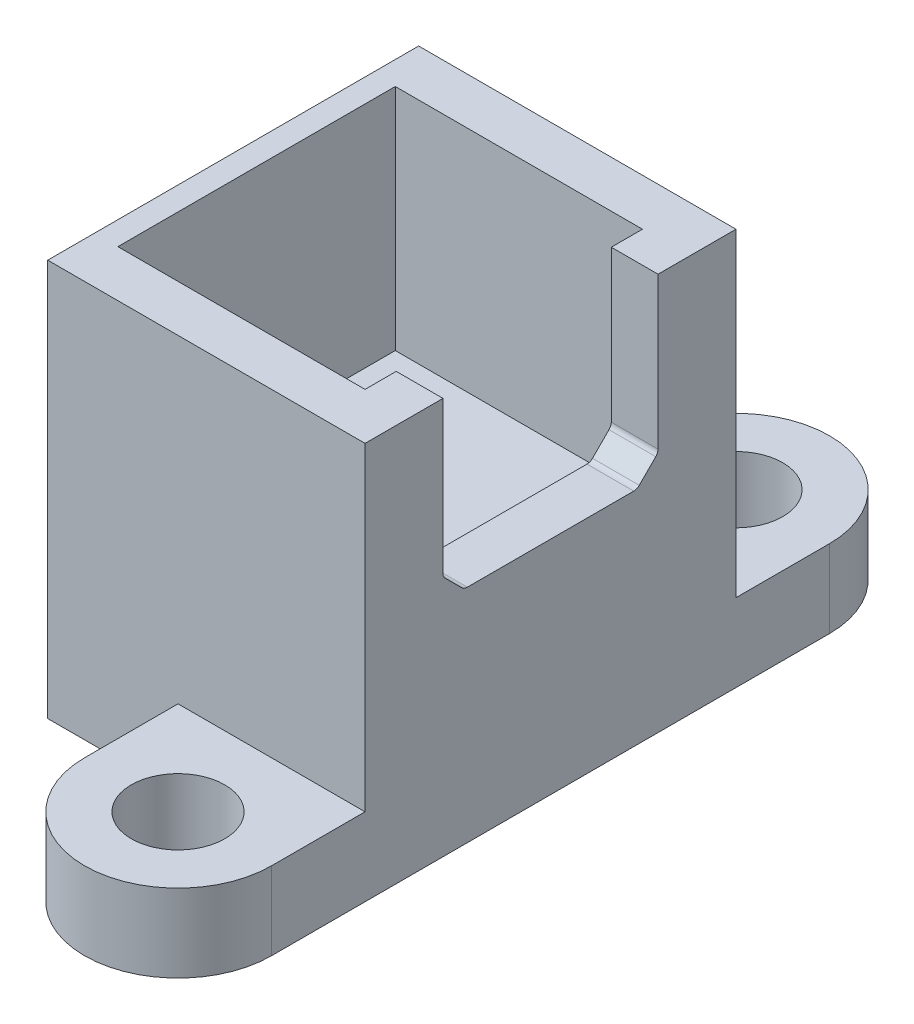
ISO-10303-21;
HEADER;
FILE_DESCRIPTION(('STEP AP214'),'2;1');
FILE_NAME('part.step','',(''),(''),'','','');
FILE_SCHEMA(('AUTOMOTIVE_DESIGN { 1 0 10303 214 1 1 1 1 }'));
ENDSEC;
DATA;
#1=APPLICATION_CONTEXT('core data for automotive mechanical design processes');
#2=APPLICATION_PROTOCOL_DEFINITION('international standard','automotive_design',2000,#1);
#3=PRODUCT_CONTEXT('',#1,'mechanical');
#4=PRODUCT('Part','Part','',(#3));
#5=PRODUCT_RELATED_PRODUCT_CATEGORY('part','',(#4));
#6=PRODUCT_DEFINITION_FORMATION('','',#4);
#7=PRODUCT_DEFINITION_CONTEXT('part definition',#1,'design');
#8=PRODUCT_DEFINITION('design','',#6,#7);
#9=PRODUCT_DEFINITION_SHAPE('','',#8);
#10=(LENGTH_UNIT() NAMED_UNIT(*) SI_UNIT(.MILLI.,.METRE.));
#11=(NAMED_UNIT(*) PLANE_ANGLE_UNIT() SI_UNIT($,.RADIAN.));
#12=(NAMED_UNIT(*) SI_UNIT($,.STERADIAN.) SOLID_ANGLE_UNIT());
#13=UNCERTAINTY_MEASURE_WITH_UNIT(LENGTH_MEASURE(1.E-05),#10,'distance_accuracy_value','');
#14=(GEOMETRIC_REPRESENTATION_CONTEXT(3) GLOBAL_UNCERTAINTY_ASSIGNED_CONTEXT((#13)) GLOBAL_UNIT_ASSIGNED_CONTEXT((#10,
#11,#12)) REPRESENTATION_CONTEXT('',''));
#15=CARTESIAN_POINT('',(0.,0.,0.));
#16=DIRECTION('',(0.,0.,1.));
#17=DIRECTION('',(1.,0.,0.));
#18=AXIS2_PLACEMENT_3D('',#15,#16,#17);
#19=CARTESIAN_POINT('',(-97.7656372295594,0.,-42.9629784183495));
#20=DIRECTION('',(0.,0.,-1.));
#21=DIRECTION('',(0.,1.,0.));
#22=AXIS2_PLACEMENT_3D('',#19,#20,#21);
#23=PLANE('',#22);
#24=DIRECTION('',(0.,-1.,0.));
#25=VECTOR('',#24,1.);
#26=CARTESIAN_POINT('',(-102.265637229559,-58.5367120778325,-42.9629784183496));
#27=LINE('',#26,#25);
#28=CARTESIAN_POINT('',(-102.265637229559,-58.5367120778325,-42.9629784183496));
#29=VERTEX_POINT('',#28);
#30=CARTESIAN_POINT('',(-102.265637229559,-61.0367120778325,-42.9629784183496));
#31=VERTEX_POINT('',#30);
#32=EDGE_CURVE('E264',#29,#31,#27,.T.);
#33=ORIENTED_EDGE('',*,*,#32,.F.);
#34=DIRECTION('',(-1.,0.,0.));
#35=VECTOR('',#34,1.);
#36=CARTESIAN_POINT('',(0.,-58.5367120778325,-42.9629784183496));
#37=LINE('',#36,#35);
#38=CARTESIAN_POINT('',(-96.2656372295594,-58.5367120778325,-42.9629784183496));
#39=VERTEX_POINT('',#38);
#40=EDGE_CURVE('E247',#39,#29,#37,.T.);
#41=ORIENTED_EDGE('',*,*,#40,.F.);
#42=DIRECTION('',(0.,1.,0.));
#43=VECTOR('',#42,1.);
#44=CARTESIAN_POINT('',(-96.2656372295594,0.,-42.9629784183495));
#45=LINE('',#44,#43);
#46=CARTESIAN_POINT('',(-96.2656372295594,-48.3001004236337,-42.9629784183496));
#47=VERTEX_POINT('',#46);
#48=EDGE_CURVE('E352',#39,#47,#45,.T.);
#49=ORIENTED_EDGE('',*,*,#48,.T.);
#50=DIRECTION('',(1.,0.,0.));
#51=VECTOR('',#50,1.);
#52=CARTESIAN_POINT('',(-97.7656372295594,-48.3001004236337,-42.9629784183496));
#53=LINE('',#52,#51);
#54=CARTESIAN_POINT('',(-106.445637229559,-48.3001004236337,-42.9629784183496));
#55=VERTEX_POINT('',#54);
#56=EDGE_CURVE('E392',#55,#47,#53,.T.);
#57=ORIENTED_EDGE('',*,*,#56,.F.);
#58=DIRECTION('',(0.,-1.,0.));
#59=VECTOR('',#58,1.);
#60=CARTESIAN_POINT('',(-106.445637229559,-89.8871446844111,-42.9629784183496));
#61=LINE('',#60,#59);
#62=CARTESIAN_POINT('',(-106.445637229559,-61.0367120778325,-42.9629784183496));
#63=VERTEX_POINT('',#62);
#64=EDGE_CURVE('E272',#55,#63,#61,.T.);
#65=ORIENTED_EDGE('',*,*,#64,.T.);
#66=DIRECTION('',(1.,0.,0.));
#67=VECTOR('',#66,1.);
#68=CARTESIAN_POINT('',(-97.7656372295594,-61.0367120778325,-42.9629784183496));
#69=LINE('',#68,#67);
#70=EDGE_CURVE('E64',#63,#31,#69,.T.);
#71=ORIENTED_EDGE('',*,*,#70,.T.);
#72=EDGE_LOOP('',(#33,#41,#49,#57,#65,#71));
#73=FACE_BOUND('',#72,.T.);
#74=ADVANCED_FACE('F41',(#73),#23,.F.);
#75=CARTESIAN_POINT('',(-97.7656372295594,-53.1562824381008,-52.1128788676088));
#76=DIRECTION('',(1.,0.,0.));
#77=DIRECTION('',(0.,0.,-1.));
#78=AXIS2_PLACEMENT_3D('',#75,#76,#77);
#79=CYLINDRICAL_SURFACE('',#78,0.250140786007739);
#80=CARTESIAN_POINT('',(-96.2656372295594,-53.1562824381008,-52.1128788676088));
#81=DIRECTION('',(-1.,0.,0.));
#82=DIRECTION('',(0.,0.,1.));
#83=AXIS2_PLACEMENT_3D('',#80,#81,#82);
#84=CIRCLE('',#83,0.250140786007739);
#85=CARTESIAN_POINT('',(-96.2656372295594,-53.3331586841382,-52.2897551136462));
#86=VERTEX_POINT('',#85);
#87=CARTESIAN_POINT('',(-96.2656372295594,-53.1608241936896,-52.3629784183496));
#88=VERTEX_POINT('',#87);
#89=EDGE_CURVE('E298',#86,#88,#84,.F.);
#90=ORIENTED_EDGE('',*,*,#89,.T.);
#91=DIRECTION('',(1.,0.,0.));
#92=VECTOR('',#91,1.);
#93=CARTESIAN_POINT('',(-97.7656372295594,-53.1608241936896,-52.3629784183496));
#94=LINE('',#93,#92);
#95=CARTESIAN_POINT('',(-97.7656372295594,-53.1608241936896,-52.3629784183496));
#96=VERTEX_POINT('',#95);
#97=EDGE_CURVE('E11',#96,#88,#94,.T.);
#98=ORIENTED_EDGE('',*,*,#97,.F.);
#99=CARTESIAN_POINT('',(-97.7656372295594,-53.1562824381008,-52.1128788676088));
#100=DIRECTION('',(-1.,0.,0.));
#101=DIRECTION('',(0.,0.,1.));
#102=AXIS2_PLACEMENT_3D('',#99,#100,#101);
#103=CIRCLE('',#102,0.250140786007739);
#104=CARTESIAN_POINT('',(-97.7656372295594,-53.3331586841382,-52.2897551136462));
#105=VERTEX_POINT('',#104);
#106=EDGE_CURVE('E312',#105,#96,#103,.F.);
#107=ORIENTED_EDGE('',*,*,#106,.F.);
#108=DIRECTION('',(1.,0.,0.));
#109=VECTOR('',#108,1.);
#110=CARTESIAN_POINT('',(-97.7656372295594,-53.3331586841382,-52.2897551136462));
#111=LINE('',#110,#109);
#112=EDGE_CURVE('E339',#105,#86,#111,.T.);
#113=ORIENTED_EDGE('',*,*,#112,.T.);
#114=EDGE_LOOP('',(#90,#98,#107,#113));
#115=FACE_BOUND('',#114,.T.);
#116=ADVANCED_FACE('F43',(#115),#79,.F.);
#117=CARTESIAN_POINT('',(-97.7656372295594,0.,-52.3629784183496));
#118=DIRECTION('',(0.,0.,-1.));
#119=DIRECTION('',(-1.,0.,0.));
#120=AXIS2_PLACEMENT_3D('',#117,#118,#119);
#121=PLANE('',#120);
#122=DIRECTION('',(0.,1.,0.));
#123=VECTOR('',#122,1.);
#124=CARTESIAN_POINT('',(-96.2656372295594,0.,-52.3629784183496));
#125=LINE('',#124,#123);
#126=CARTESIAN_POINT('',(-96.2656372295594,-48.3001004236337,-52.3629784183496));
#127=VERTEX_POINT('',#126);
#128=EDGE_CURVE('E342',#88,#127,#125,.T.);
#129=ORIENTED_EDGE('',*,*,#128,.T.);
#130=DIRECTION('',(1.,0.,0.));
#131=VECTOR('',#130,1.);
#132=CARTESIAN_POINT('',(-97.7656372295594,-48.3001004236337,-52.3629784183496));
#133=LINE('',#132,#131);
#134=CARTESIAN_POINT('',(-97.7656372295594,-48.3001004236337,-52.3629784183496));
#135=VERTEX_POINT('',#134);
#136=EDGE_CURVE('E49',#135,#127,#133,.T.);
#137=ORIENTED_EDGE('',*,*,#136,.F.);
#138=DIRECTION('',(0.,1.,0.));
#139=VECTOR('',#138,1.);
#140=CARTESIAN_POINT('',(-97.7656372295594,0.,-52.3629784183496));
#141=LINE('',#140,#139);
#142=EDGE_CURVE('E315',#96,#135,#141,.T.);
#143=ORIENTED_EDGE('',*,*,#142,.F.);
#144=ORIENTED_EDGE('',*,*,#97,.T.);
#145=EDGE_LOOP('',(#129,#137,#143,#144));
#146=FACE_BOUND('',#145,.T.);
#147=ADVANCED_FACE('F406',(#146),#121,.F.);
#148=CARTESIAN_POINT('',(-97.7656372295594,0.,-54.8629784183496));
#149=DIRECTION('',(0.,0.,-1.));
#150=DIRECTION('',(-1.,0.,0.));
#151=AXIS2_PLACEMENT_3D('',#148,#149,#150);
#152=PLANE('',#151);
#153=DIRECTION('',(1.,0.,0.));
#154=VECTOR('',#153,1.);
#155=CARTESIAN_POINT('',(0.,-58.5367120778325,-54.8629784183496));
#156=LINE('',#155,#154);
#157=CARTESIAN_POINT('',(-102.265637229559,-58.5367120778325,-54.8629784183496));
#158=VERTEX_POINT('',#157);
#159=CARTESIAN_POINT('',(-96.2656372295594,-58.5367120778325,-54.8629784183496));
#160=VERTEX_POINT('',#159);
#161=EDGE_CURVE('E211',#158,#160,#156,.T.);
#162=ORIENTED_EDGE('',*,*,#161,.F.);
#163=DIRECTION('',(0.,-1.,0.));
#164=VECTOR('',#163,1.);
#165=CARTESIAN_POINT('',(-102.265637229559,-58.5367120778325,-54.8629784183496));
#166=LINE('',#165,#164);
#167=CARTESIAN_POINT('',(-102.265637229559,-61.0367120778325,-54.8629784183496));
#168=VERTEX_POINT('',#167);
#169=EDGE_CURVE('E223',#158,#168,#166,.T.);
#170=ORIENTED_EDGE('',*,*,#169,.T.);
#171=DIRECTION('',(1.,0.,0.));
#172=VECTOR('',#171,1.);
#173=CARTESIAN_POINT('',(-97.7656372295594,-61.0367120778325,-54.8629784183496));
#174=LINE('',#173,#172);
#175=CARTESIAN_POINT('',(-106.445637229559,-61.0367120778325,-54.8629784183496));
#176=VERTEX_POINT('',#175);
#177=EDGE_CURVE('E396',#176,#168,#174,.T.);
#178=ORIENTED_EDGE('',*,*,#177,.F.);
#179=DIRECTION('',(0.,-1.,0.));
#180=VECTOR('',#179,1.);
#181=CARTESIAN_POINT('',(-106.445637229559,-89.8871446844113,-54.8629784183496));
#182=LINE('',#181,#180);
#183=CARTESIAN_POINT('',(-106.445637229559,-48.3001004236337,-54.8629784183496));
#184=VERTEX_POINT('',#183);
#185=EDGE_CURVE('E276',#184,#176,#182,.T.);
#186=ORIENTED_EDGE('',*,*,#185,.F.);
#187=DIRECTION('',(1.,0.,0.));
#188=VECTOR('',#187,1.);
#189=CARTESIAN_POINT('',(-97.7656372295594,-48.3001004236337,-54.8629784183496));
#190=LINE('',#189,#188);
#191=CARTESIAN_POINT('',(-96.2656372295594,-48.3001004236337,-54.8629784183496));
#192=VERTEX_POINT('',#191);
#193=EDGE_CURVE('E399',#184,#192,#190,.T.);
#194=ORIENTED_EDGE('',*,*,#193,.T.);
#195=DIRECTION('',(0.,1.,0.));
#196=VECTOR('',#195,1.);
#197=CARTESIAN_POINT('',(-96.2656372295594,0.,-54.8629784183496));
#198=LINE('',#197,#196);
#199=EDGE_CURVE('E348',#160,#192,#198,.T.);
#200=ORIENTED_EDGE('',*,*,#199,.F.);
#201=EDGE_LOOP('',(#162,#170,#178,#186,#194,#200));
#202=FACE_BOUND('',#201,.T.);
#203=ADVANCED_FACE('F414',(#202),#152,.T.);
#204=CARTESIAN_POINT('',(-97.7656372295594,-61.0367120778325,0.));
#205=DIRECTION('',(0.,1.,0.));
#206=DIRECTION('',(0.,0.,1.));
#207=AXIS2_PLACEMENT_3D('',#204,#205,#206);
#208=PLANE('',#207);
#209=DIRECTION('',(0.,0.,1.));
#210=VECTOR('',#209,1.);
#211=CARTESIAN_POINT('',(-96.2656372295594,-61.0367120778325,0.));
#212=LINE('',#211,#210);
#213=CARTESIAN_POINT('',(-96.2656372295594,-61.0367120778325,-57.8629784183496));
#214=VERTEX_POINT('',#213);
#215=CARTESIAN_POINT('',(-96.2656372295594,-61.0367120778325,-39.9629784183496));
#216=VERTEX_POINT('',#215);
#217=EDGE_CURVE('E350',#214,#216,#212,.T.);
#218=ORIENTED_EDGE('',*,*,#217,.T.);
#219=CARTESIAN_POINT('',(-99.2656372295594,-61.0367120778325,-39.9629784183496));
#220=DIRECTION('',(0.,-1.,0.));
#221=DIRECTION('',(0.,0.,-1.));
#222=AXIS2_PLACEMENT_3D('',#219,#220,#221);
#223=CIRCLE('',#222,3.);
#224=CARTESIAN_POINT('',(-102.265637229559,-61.0367120778325,-39.9629784183496));
#225=VERTEX_POINT('',#224);
#226=EDGE_CURVE('E256',#225,#216,#223,.F.);
#227=ORIENTED_EDGE('',*,*,#226,.F.);
#228=DIRECTION('',(0.,0.,1.));
#229=VECTOR('',#228,1.);
#230=CARTESIAN_POINT('',(-102.265637229559,-61.0367120778325,0.));
#231=LINE('',#230,#229);
#232=EDGE_CURVE('E243',#31,#225,#231,.T.);
#233=ORIENTED_EDGE('',*,*,#232,.F.);
#234=ORIENTED_EDGE('',*,*,#70,.F.);
#235=DIRECTION('',(0.,0.,-1.));
#236=VECTOR('',#235,1.);
#237=CARTESIAN_POINT('',(-106.445637229559,-61.0367120778325,66.5870215816506));
#238=LINE('',#237,#236);
#239=EDGE_CURVE('E263',#63,#176,#238,.T.);
#240=ORIENTED_EDGE('',*,*,#239,.T.);
#241=ORIENTED_EDGE('',*,*,#177,.T.);
#242=DIRECTION('',(0.,0.,-1.));
#243=VECTOR('',#242,1.);
#244=CARTESIAN_POINT('',(-102.26563722956,-61.0367120778325,-4.73073604500918E-13));
#245=LINE('',#244,#243);
#246=CARTESIAN_POINT('',(-102.265637229559,-61.0367120778325,-57.8629784183496));
#247=VERTEX_POINT('',#246);
#248=EDGE_CURVE('E56',#168,#247,#245,.T.);
#249=ORIENTED_EDGE('',*,*,#248,.T.);
#250=CARTESIAN_POINT('',(-99.2656372295594,-61.0367120778325,-57.8629784183496));
#251=DIRECTION('',(0.,-1.,0.));
#252=DIRECTION('',(0.,0.,-1.));
#253=AXIS2_PLACEMENT_3D('',#250,#251,#252);
#254=CIRCLE('',#253,2.99999999999999);
#255=EDGE_CURVE('E208',#247,#214,#254,.T.);
#256=ORIENTED_EDGE('',*,*,#255,.T.);
#257=EDGE_LOOP('',(#218,#227,#233,#234,#240,#241,#249,#256));
#258=FACE_BOUND('',#257,.T.);
#259=CARTESIAN_POINT('',(-99.2656372295594,-61.0367120778325,-39.9629784183496));
#260=DIRECTION('',(0.,-1.,0.));
#261=DIRECTION('',(0.,0.,-1.));
#262=AXIS2_PLACEMENT_3D('',#259,#260,#261);
#263=CIRCLE('',#262,1.5);
#264=CARTESIAN_POINT('',(-99.2656372295594,-61.0367120778325,-41.4629784183496));
#265=VERTEX_POINT('',#264);
#266=EDGE_CURVE('E237',#265,#265,#263,.T.);
#267=ORIENTED_EDGE('',*,*,#266,.F.);
#268=EDGE_LOOP('',(#267));
#269=FACE_BOUND('',#268,.T.);
#270=CARTESIAN_POINT('',(-99.2656372295594,-61.0367120778325,-57.8629784183496));
#271=DIRECTION('',(0.,-1.,0.));
#272=DIRECTION('',(0.,0.,-1.));
#273=AXIS2_PLACEMENT_3D('',#270,#271,#272);
#274=CIRCLE('',#273,1.5);
#275=CARTESIAN_POINT('',(-99.2656372295594,-61.0367120778325,-59.3629784183496));
#276=VERTEX_POINT('',#275);
#277=EDGE_CURVE('E231',#276,#276,#274,.T.);
#278=ORIENTED_EDGE('',*,*,#277,.F.);
#279=EDGE_LOOP('',(#278));
#280=FACE_BOUND('',#279,.T.);
#281=ADVANCED_FACE('F433',(#258,#269,#280),#208,.F.);
#282=CARTESIAN_POINT('',(-97.7656372295594,-48.3001004236337,0.));
#283=DIRECTION('',(0.,-1.,0.));
#284=DIRECTION('',(0.,0.,-1.));
#285=AXIS2_PLACEMENT_3D('',#282,#283,#284);
#286=PLANE('',#285);
#287=DIRECTION('',(0.,0.,-1.));
#288=VECTOR('',#287,1.);
#289=CARTESIAN_POINT('',(-96.2656372295594,-48.3001004236337,0.));
#290=LINE('',#289,#288);
#291=CARTESIAN_POINT('',(-96.2656372295594,-48.3001004236337,-45.4629784183496));
#292=VERTEX_POINT('',#291);
#293=EDGE_CURVE('E354',#47,#292,#290,.T.);
#294=ORIENTED_EDGE('',*,*,#293,.T.);
#295=DIRECTION('',(1.,0.,0.));
#296=VECTOR('',#295,1.);
#297=CARTESIAN_POINT('',(-97.7656372295594,-48.3001004236337,-45.4629784183496));
#298=LINE('',#297,#296);
#299=CARTESIAN_POINT('',(-97.7656372295594,-48.3001004236337,-45.4629784183496));
#300=VERTEX_POINT('',#299);
#301=EDGE_CURVE('E390',#300,#292,#298,.T.);
#302=ORIENTED_EDGE('',*,*,#301,.F.);
#303=DIRECTION('',(0.,0.,-1.));
#304=VECTOR('',#303,1.);
#305=CARTESIAN_POINT('',(-97.7656372295594,-48.3001004236337,0.));
#306=LINE('',#305,#304);
#307=CARTESIAN_POINT('',(-97.7656372295594,-48.3001004236337,-44.4629784183496));
#308=VERTEX_POINT('',#307);
#309=EDGE_CURVE('E321',#308,#300,#306,.T.);
#310=ORIENTED_EDGE('',*,*,#309,.F.);
#311=DIRECTION('',(1.,0.,0.));
#312=VECTOR('',#311,1.);
#313=CARTESIAN_POINT('',(-123.876393851975,-48.3001004236337,-44.4629784183496));
#314=LINE('',#313,#312);
#315=CARTESIAN_POINT('',(-105.695637229559,-48.3001004236337,-44.4629784183496));
#316=VERTEX_POINT('',#315);
#317=EDGE_CURVE('E294',#316,#308,#314,.T.);
#318=ORIENTED_EDGE('',*,*,#317,.F.);
#319=DIRECTION('',(0.,0.,-1.));
#320=VECTOR('',#319,1.);
#321=CARTESIAN_POINT('',(-105.695637229559,-48.3001004236337,66.5870215816507));
#322=LINE('',#321,#320);
#323=CARTESIAN_POINT('',(-105.695637229559,-48.3001004236337,-53.3629784183496));
#324=VERTEX_POINT('',#323);
#325=EDGE_CURVE('E268',#316,#324,#322,.T.);
#326=ORIENTED_EDGE('',*,*,#325,.T.);
#327=DIRECTION('',(1.,0.,0.));
#328=VECTOR('',#327,1.);
#329=CARTESIAN_POINT('',(-123.876393851975,-48.3001004236337,-53.3629784183496));
#330=LINE('',#329,#328);
#331=CARTESIAN_POINT('',(-97.7656372295594,-48.3001004236337,-53.3629784183496));
#332=VERTEX_POINT('',#331);
#333=EDGE_CURVE('E279',#324,#332,#330,.T.);
#334=ORIENTED_EDGE('',*,*,#333,.T.);
#335=DIRECTION('',(0.,0.,1.));
#336=VECTOR('',#335,1.);
#337=CARTESIAN_POINT('',(-97.7656372295594,-48.3001004236337,0.));
#338=LINE('',#337,#336);
#339=EDGE_CURVE('E319',#332,#135,#338,.T.);
#340=ORIENTED_EDGE('',*,*,#339,.T.);
#341=ORIENTED_EDGE('',*,*,#136,.T.);
#342=DIRECTION('',(0.,0.,1.));
#343=VECTOR('',#342,1.);
#344=CARTESIAN_POINT('',(-96.2656372295594,-48.3001004236337,0.));
#345=LINE('',#344,#343);
#346=EDGE_CURVE('E345',#192,#127,#345,.T.);
#347=ORIENTED_EDGE('',*,*,#346,.F.);
#348=ORIENTED_EDGE('',*,*,#193,.F.);
#349=DIRECTION('',(0.,0.,-1.));
#350=VECTOR('',#349,1.);
#351=CARTESIAN_POINT('',(-106.445637229559,-48.3001004236337,66.5870215816506));
#352=LINE('',#351,#350);
#353=EDGE_CURVE('E271',#55,#184,#352,.T.);
#354=ORIENTED_EDGE('',*,*,#353,.F.);
#355=ORIENTED_EDGE('',*,*,#56,.T.);
#356=EDGE_LOOP('',(#294,#302,#310,#318,#326,#334,#340,#341,#347,#348,#354,#355));
#357=FACE_BOUND('',#356,.T.);
#358=ADVANCED_FACE('F404',(#357),#286,.F.);
#359=CARTESIAN_POINT('',(-97.7656372295594,0.,-45.4629784183496));
#360=DIRECTION('',(0.,0.,-1.));
#361=DIRECTION('',(-1.,0.,0.));
#362=AXIS2_PLACEMENT_3D('',#359,#360,#361);
#363=PLANE('',#362);
#364=DIRECTION('',(0.,1.,0.));
#365=VECTOR('',#364,1.);
#366=CARTESIAN_POINT('',(-96.2656372295594,0.,-45.4629784183496));
#367=LINE('',#366,#365);
#368=CARTESIAN_POINT('',(-96.2656372295594,-53.1563819888416,-45.4629784183496));
#369=VERTEX_POINT('',#368);
#370=EDGE_CURVE('E357',#369,#292,#367,.T.);
#371=ORIENTED_EDGE('',*,*,#370,.F.);
#372=DIRECTION('',(1.,0.,0.));
#373=VECTOR('',#372,1.);
#374=CARTESIAN_POINT('',(-97.7656372295594,-53.1563819888416,-45.4629784183496));
#375=LINE('',#374,#373);
#376=CARTESIAN_POINT('',(-97.7656372295594,-53.1563819888416,-45.4629784183496));
#377=VERTEX_POINT('',#376);
#378=EDGE_CURVE('E388',#377,#369,#375,.T.);
#379=ORIENTED_EDGE('',*,*,#378,.F.);
#380=DIRECTION('',(0.,1.,0.));
#381=VECTOR('',#380,1.);
#382=CARTESIAN_POINT('',(-97.7656372295594,0.,-45.4629784183496));
#383=LINE('',#382,#381);
#384=EDGE_CURVE('E323',#377,#300,#383,.T.);
#385=ORIENTED_EDGE('',*,*,#384,.T.);
#386=ORIENTED_EDGE('',*,*,#301,.T.);
#387=EDGE_LOOP('',(#371,#379,#385,#386));
#388=FACE_BOUND('',#387,.T.);
#389=ADVANCED_FACE('F483',(#388),#363,.T.);
#390=CARTESIAN_POINT('',(-97.7656372295594,-53.1563819888416,-45.7129784183496));
#391=DIRECTION('',(1.,0.,0.));
#392=DIRECTION('',(0.,0.,-1.));
#393=AXIS2_PLACEMENT_3D('',#390,#391,#392);
#394=CYLINDRICAL_SURFACE('',#393,0.249999999999979);
#395=CARTESIAN_POINT('',(-96.2656372295594,-53.1563819888416,-45.7129784183496));
#396=DIRECTION('',(-1.,0.,0.));
#397=DIRECTION('',(0.,0.,1.));
#398=AXIS2_PLACEMENT_3D('',#395,#396,#397);
#399=CIRCLE('',#398,0.249999999999979);
#400=CARTESIAN_POINT('',(-96.2656372295594,-53.3331586841382,-45.5362017230529));
#401=VERTEX_POINT('',#400);
#402=EDGE_CURVE('E360',#369,#401,#399,.F.);
#403=ORIENTED_EDGE('',*,*,#402,.T.);
#404=DIRECTION('',(1.,0.,0.));
#405=VECTOR('',#404,1.);
#406=CARTESIAN_POINT('',(-97.7656372295594,-53.3331586841382,-45.5362017230529));
#407=LINE('',#406,#405);
#408=CARTESIAN_POINT('',(-97.7656372295594,-53.3331586841382,-45.5362017230529));
#409=VERTEX_POINT('',#408);
#410=EDGE_CURVE('E385',#409,#401,#407,.T.);
#411=ORIENTED_EDGE('',*,*,#410,.F.);
#412=CARTESIAN_POINT('',(-97.7656372295594,-53.1563819888416,-45.7129784183496));
#413=DIRECTION('',(-1.,0.,0.));
#414=DIRECTION('',(0.,0.,1.));
#415=AXIS2_PLACEMENT_3D('',#412,#413,#414);
#416=CIRCLE('',#415,0.249999999999979);
#417=EDGE_CURVE('E326',#377,#409,#416,.F.);
#418=ORIENTED_EDGE('',*,*,#417,.F.);
#419=ORIENTED_EDGE('',*,*,#378,.T.);
#420=EDGE_LOOP('',(#403,#411,#418,#419));
#421=FACE_BOUND('',#420,.T.);
#422=ADVANCED_FACE('F490',(#421),#394,.F.);
#423=CARTESIAN_POINT('',(-97.7656372295594,-3.89847848054264,3.89847848054264));
#424=DIRECTION('',(0.,-0.707106781186547,0.707106781186547));
#425=DIRECTION('',(0.,-0.707106781186548,-0.707106781186548));
#426=AXIS2_PLACEMENT_3D('',#423,#424,#425);
#427=PLANE('',#426);
#428=DIRECTION('',(0.,-0.707106781186548,-0.707106781186548));
#429=VECTOR('',#428,1.);
#430=CARTESIAN_POINT('',(-96.2656372295594,-3.89847848054264,3.89847848054264));
#431=LINE('',#430,#429);
#432=CARTESIAN_POINT('',(-96.2656372295594,-53.8634887698543,-46.066531808769));
#433=VERTEX_POINT('',#432);
#434=EDGE_CURVE('E362',#401,#433,#431,.T.);
#435=ORIENTED_EDGE('',*,*,#434,.T.);
#436=DIRECTION('',(1.,0.,0.));
#437=VECTOR('',#436,1.);
#438=CARTESIAN_POINT('',(-97.7656372295594,-53.8634887698543,-46.066531808769));
#439=LINE('',#438,#437);
#440=CARTESIAN_POINT('',(-97.7656372295594,-53.8634887698543,-46.066531808769));
#441=VERTEX_POINT('',#440);
#442=EDGE_CURVE('E382',#441,#433,#439,.T.);
#443=ORIENTED_EDGE('',*,*,#442,.F.);
#444=DIRECTION('',(0.,-0.707106781186548,-0.707106781186548));
#445=VECTOR('',#444,1.);
#446=CARTESIAN_POINT('',(-97.7656372295594,-3.89847848054264,3.89847848054264));
#447=LINE('',#446,#445);
#448=EDGE_CURVE('E328',#409,#441,#447,.T.);
#449=ORIENTED_EDGE('',*,*,#448,.F.);
#450=ORIENTED_EDGE('',*,*,#410,.T.);
#451=EDGE_LOOP('',(#435,#443,#449,#450));
#452=FACE_BOUND('',#451,.T.);
#453=ADVANCED_FACE('F497',(#452),#427,.F.);
#454=CARTESIAN_POINT('',(-97.7656372295594,-53.6867120745576,-46.2433085040656));
#455=DIRECTION('',(1.,0.,0.));
#456=DIRECTION('',(0.,0.,-1.));
#457=AXIS2_PLACEMENT_3D('',#454,#455,#456);
#458=CYLINDRICAL_SURFACE('',#457,0.249999999999979);
#459=CARTESIAN_POINT('',(-96.2656372295594,-53.6867120745576,-46.2433085040656));
#460=DIRECTION('',(-1.,0.,0.));
#461=DIRECTION('',(0.,0.,1.));
#462=AXIS2_PLACEMENT_3D('',#459,#460,#461);
#463=CIRCLE('',#462,0.249999999999979);
#464=CARTESIAN_POINT('',(-96.2656372295594,-53.9367120745576,-46.2433085040656));
#465=VERTEX_POINT('',#464);
#466=EDGE_CURVE('E364',#433,#465,#463,.F.);
#467=ORIENTED_EDGE('',*,*,#466,.T.);
#468=DIRECTION('',(1.,0.,0.));
#469=VECTOR('',#468,1.);
#470=CARTESIAN_POINT('',(-97.7656372295594,-53.9367120745576,-46.2433085040656));
#471=LINE('',#470,#469);
#472=CARTESIAN_POINT('',(-97.7656372295594,-53.9367120745576,-46.2433085040656));
#473=VERTEX_POINT('',#472);
#474=EDGE_CURVE('E379',#473,#465,#471,.T.);
#475=ORIENTED_EDGE('',*,*,#474,.F.);
#476=CARTESIAN_POINT('',(-97.7656372295594,-53.6867120745576,-46.2433085040656));
#477=DIRECTION('',(-1.,0.,0.));
#478=DIRECTION('',(0.,0.,1.));
#479=AXIS2_PLACEMENT_3D('',#476,#477,#478);
#480=CIRCLE('',#479,0.249999999999979);
#481=EDGE_CURVE('E330',#441,#473,#480,.F.);
#482=ORIENTED_EDGE('',*,*,#481,.F.);
#483=ORIENTED_EDGE('',*,*,#442,.T.);
#484=EDGE_LOOP('',(#467,#475,#482,#483));
#485=FACE_BOUND('',#484,.T.);
#486=ADVANCED_FACE('F505',(#485),#458,.F.);
#487=CARTESIAN_POINT('',(-97.7656372295594,-53.9367120461949,3.3081413950793E-08));
#488=DIRECTION('',(0.,-1.,6.13337608018448E-10));
#489=DIRECTION('',(0.,-6.13337608018448E-10,-1.));
#490=AXIS2_PLACEMENT_3D('',#487,#488,#489);
#491=PLANE('',#490);
#492=DIRECTION('',(0.,-6.13337608018448E-10,-1.));
#493=VECTOR('',#492,1.);
#494=CARTESIAN_POINT('',(-96.2656372295594,-53.9367120461949,3.3081413950793E-08));
#495=LINE('',#494,#493);
#496=CARTESIAN_POINT('',(-96.2656372295594,-53.9367120778324,-51.5826483293587));
#497=VERTEX_POINT('',#496);
#498=EDGE_CURVE('E366',#465,#497,#495,.T.);
#499=ORIENTED_EDGE('',*,*,#498,.T.);
#500=DIRECTION('',(1.,0.,0.));
#501=VECTOR('',#500,1.);
#502=CARTESIAN_POINT('',(-97.7656372295594,-53.9367120778324,-51.5826483293587));
#503=LINE('',#502,#501);
#504=CARTESIAN_POINT('',(-97.7656372295594,-53.9367120778324,-51.5826483293587));
#505=VERTEX_POINT('',#504);
#506=EDGE_CURVE('E376',#505,#497,#503,.T.);
#507=ORIENTED_EDGE('',*,*,#506,.F.);
#508=DIRECTION('',(0.,-6.13337608018448E-10,-1.));
#509=VECTOR('',#508,1.);
#510=CARTESIAN_POINT('',(-97.7656372295594,-53.9367120461949,3.3081413950793E-08));
#511=LINE('',#510,#509);
#512=EDGE_CURVE('E332',#473,#505,#511,.T.);
#513=ORIENTED_EDGE('',*,*,#512,.F.);
#514=ORIENTED_EDGE('',*,*,#474,.T.);
#515=EDGE_LOOP('',(#499,#507,#513,#514));
#516=FACE_BOUND('',#515,.T.);
#517=ADVANCED_FACE('F513',(#516),#491,.F.);
#518=CARTESIAN_POINT('',(-97.7656372295594,-53.6867120778324,-51.5826483293587));
#519=DIRECTION('',(1.,0.,0.));
#520=DIRECTION('',(0.,0.,-1.));
#521=AXIS2_PLACEMENT_3D('',#518,#519,#520);
#522=CYLINDRICAL_SURFACE('',#521,0.249999999999994);
#523=CARTESIAN_POINT('',(-96.2656372295594,-53.6867120778324,-51.5826483293587));
#524=DIRECTION('',(-1.,0.,0.));
#525=DIRECTION('',(0.,0.,1.));
#526=AXIS2_PLACEMENT_3D('',#523,#524,#525);
#527=CIRCLE('',#526,0.249999999999994);
#528=CARTESIAN_POINT('',(-96.2656372295594,-53.8634887731291,-51.7594250246554));
#529=VERTEX_POINT('',#528);
#530=EDGE_CURVE('E368',#497,#529,#527,.F.);
#531=ORIENTED_EDGE('',*,*,#530,.T.);
#532=DIRECTION('',(1.,0.,0.));
#533=VECTOR('',#532,1.);
#534=CARTESIAN_POINT('',(-97.7656372295594,-53.8634887731291,-51.7594250246554));
#535=LINE('',#534,#533);
#536=CARTESIAN_POINT('',(-97.7656372295594,-53.8634887731291,-51.7594250246554));
#537=VERTEX_POINT('',#536);
#538=EDGE_CURVE('E374',#537,#529,#535,.T.);
#539=ORIENTED_EDGE('',*,*,#538,.F.);
#540=CARTESIAN_POINT('',(-97.7656372295594,-53.6867120778324,-51.5826483293587));
#541=DIRECTION('',(-1.,0.,0.));
#542=DIRECTION('',(0.,0.,1.));
#543=AXIS2_PLACEMENT_3D('',#540,#541,#542);
#544=CIRCLE('',#543,0.249999999999994);
#545=EDGE_CURVE('E334',#505,#537,#544,.F.);
#546=ORIENTED_EDGE('',*,*,#545,.F.);
#547=ORIENTED_EDGE('',*,*,#506,.T.);
#548=EDGE_LOOP('',(#531,#539,#546,#547));
#549=FACE_BOUND('',#548,.T.);
#550=ADVANCED_FACE('F521',(#549),#522,.F.);
#551=CARTESIAN_POINT('',(-97.7656372295594,-52.8114568988922,-52.8114568988922));
#552=DIRECTION('',(0.,0.707106781186547,0.707106781186547));
#553=DIRECTION('',(0.,-0.707106781186548,0.707106781186548));
#554=AXIS2_PLACEMENT_3D('',#551,#552,#553);
#555=PLANE('',#554);
#556=DIRECTION('',(0.,-0.707106781186548,0.707106781186548));
#557=VECTOR('',#556,1.);
#558=CARTESIAN_POINT('',(-96.2656372295594,-52.8114568988922,-52.8114568988922));
#559=LINE('',#558,#557);
#560=EDGE_CURVE('E316',#86,#529,#559,.T.);
#561=ORIENTED_EDGE('',*,*,#560,.F.);
#562=ORIENTED_EDGE('',*,*,#112,.F.);
#563=DIRECTION('',(0.,-0.707106781186548,0.707106781186548));
#564=VECTOR('',#563,1.);
#565=CARTESIAN_POINT('',(-97.7656372295594,-52.8114568988922,-52.8114568988922));
#566=LINE('',#565,#564);
#567=EDGE_CURVE('E336',#105,#537,#566,.T.);
#568=ORIENTED_EDGE('',*,*,#567,.T.);
#569=ORIENTED_EDGE('',*,*,#538,.T.);
#570=EDGE_LOOP('',(#561,#562,#568,#569));
#571=FACE_BOUND('',#570,.T.);
#572=ADVANCED_FACE('F529',(#571),#555,.T.);
#573=CARTESIAN_POINT('',(-97.7656372295594,0.,0.));
#574=DIRECTION('',(-1.,0.,0.));
#575=DIRECTION('',(0.,0.,1.));
#576=AXIS2_PLACEMENT_3D('',#573,#574,#575);
#577=PLANE('',#576);
#578=DIRECTION('',(0.,1.,0.));
#579=VECTOR('',#578,1.);
#580=CARTESIAN_POINT('',(-97.7656372295594,0.,-53.3629784183496));
#581=LINE('',#580,#579);
#582=CARTESIAN_POINT('',(-97.7656372295594,-55.6367120778324,-53.3629784183496));
#583=VERTEX_POINT('',#582);
#584=EDGE_CURVE('E282',#583,#332,#581,.T.);
#585=ORIENTED_EDGE('',*,*,#584,.F.);
#586=DIRECTION('',(0.,0.,-1.));
#587=VECTOR('',#586,1.);
#588=CARTESIAN_POINT('',(-97.7656372295594,-55.6367120778324,0.));
#589=LINE('',#588,#587);
#590=CARTESIAN_POINT('',(-97.7656372295594,-55.6367120778324,-44.4629784183496));
#591=VERTEX_POINT('',#590);
#592=EDGE_CURVE('E287',#591,#583,#589,.T.);
#593=ORIENTED_EDGE('',*,*,#592,.F.);
#594=DIRECTION('',(0.,-1.,0.));
#595=VECTOR('',#594,1.);
#596=CARTESIAN_POINT('',(-97.7656372295594,0.,-44.4629784183496));
#597=LINE('',#596,#595);
#598=EDGE_CURVE('E291',#308,#591,#597,.T.);
#599=ORIENTED_EDGE('',*,*,#598,.F.);
#600=ORIENTED_EDGE('',*,*,#309,.T.);
#601=ORIENTED_EDGE('',*,*,#384,.F.);
#602=ORIENTED_EDGE('',*,*,#417,.T.);
#603=ORIENTED_EDGE('',*,*,#448,.T.);
#604=ORIENTED_EDGE('',*,*,#481,.T.);
#605=ORIENTED_EDGE('',*,*,#512,.T.);
#606=ORIENTED_EDGE('',*,*,#545,.T.);
#607=ORIENTED_EDGE('',*,*,#567,.F.);
#608=ORIENTED_EDGE('',*,*,#106,.T.);
#609=ORIENTED_EDGE('',*,*,#142,.T.);
#610=ORIENTED_EDGE('',*,*,#339,.F.);
#611=EDGE_LOOP('',(#585,#593,#599,#600,#601,#602,#603,#604,#605,#606,#607,#608,#609,#610));
#612=FACE_BOUND('',#611,.T.);
#613=ADVANCED_FACE('F537',(#612),#577,.T.);
#614=CARTESIAN_POINT('',(-96.2656372295594,0.,0.));
#615=DIRECTION('',(-1.,0.,0.));
#616=DIRECTION('',(0.,0.,1.));
#617=AXIS2_PLACEMENT_3D('',#614,#615,#616);
#618=PLANE('',#617);
#619=ORIENTED_EDGE('',*,*,#89,.F.);
#620=ORIENTED_EDGE('',*,*,#560,.T.);
#621=ORIENTED_EDGE('',*,*,#530,.F.);
#622=ORIENTED_EDGE('',*,*,#498,.F.);
#623=ORIENTED_EDGE('',*,*,#466,.F.);
#624=ORIENTED_EDGE('',*,*,#434,.F.);
#625=ORIENTED_EDGE('',*,*,#402,.F.);
#626=ORIENTED_EDGE('',*,*,#370,.T.);
#627=ORIENTED_EDGE('',*,*,#293,.F.);
#628=ORIENTED_EDGE('',*,*,#48,.F.);
#629=DIRECTION('',(0.,0.,1.));
#630=VECTOR('',#629,1.);
#631=CARTESIAN_POINT('',(-96.2656372295596,-58.5367120778325,-4.45318028885289E-13));
#632=LINE('',#631,#630);
#633=CARTESIAN_POINT('',(-96.2656372295594,-58.5367120778325,-39.9629784183496));
#634=VERTEX_POINT('',#633);
#635=EDGE_CURVE('E250',#39,#634,#632,.T.);
#636=ORIENTED_EDGE('',*,*,#635,.T.);
#637=DIRECTION('',(0.,-1.,0.));
#638=VECTOR('',#637,1.);
#639=CARTESIAN_POINT('',(-96.2656372295594,-58.5367120778325,-39.9629784183496));
#640=LINE('',#639,#638);
#641=EDGE_CURVE('E260',#634,#216,#640,.T.);
#642=ORIENTED_EDGE('',*,*,#641,.T.);
#643=ORIENTED_EDGE('',*,*,#217,.F.);
#644=DIRECTION('',(0.,-1.,0.));
#645=VECTOR('',#644,1.);
#646=CARTESIAN_POINT('',(-96.2656372295594,-58.5367120778325,-57.8629784183496));
#647=LINE('',#646,#645);
#648=CARTESIAN_POINT('',(-96.2656372295594,-58.5367120778325,-57.8629784183496));
#649=VERTEX_POINT('',#648);
#650=EDGE_CURVE('E210',#649,#214,#647,.T.);
#651=ORIENTED_EDGE('',*,*,#650,.F.);
#652=DIRECTION('',(0.,0.,-1.));
#653=VECTOR('',#652,1.);
#654=CARTESIAN_POINT('',(-96.2656372295592,-58.5367120778325,4.45318028885288E-13));
#655=LINE('',#654,#653);
#656=EDGE_CURVE('E219',#160,#649,#655,.T.);
#657=ORIENTED_EDGE('',*,*,#656,.F.);
#658=ORIENTED_EDGE('',*,*,#199,.T.);
#659=ORIENTED_EDGE('',*,*,#346,.T.);
#660=ORIENTED_EDGE('',*,*,#128,.F.);
#661=EDGE_LOOP('',(#619,#620,#621,#622,#623,#624,#625,#626,#627,#628,#636,#642,#643,#651,#657,
#658,#659,#660));
#662=FACE_BOUND('',#661,.T.);
#663=ADVANCED_FACE('F410',(#662),#618,.F.);
#664=CARTESIAN_POINT('',(-123.876393851975,0.,-44.4629784183496));
#665=DIRECTION('',(0.,0.,1.));
#666=DIRECTION('',(1.,0.,0.));
#667=AXIS2_PLACEMENT_3D('',#664,#665,#666);
#668=PLANE('',#667);
#669=DIRECTION('',(0.,-1.,0.));
#670=VECTOR('',#669,1.);
#671=CARTESIAN_POINT('',(-105.695637229559,0.,-44.4629784183496));
#672=LINE('',#671,#670);
#673=CARTESIAN_POINT('',(-105.695637229559,-55.6367120778324,-44.4629784183496));
#674=VERTEX_POINT('',#673);
#675=EDGE_CURVE('E299',#316,#674,#672,.T.);
#676=ORIENTED_EDGE('',*,*,#675,.F.);
#677=ORIENTED_EDGE('',*,*,#317,.T.);
#678=ORIENTED_EDGE('',*,*,#598,.T.);
#679=DIRECTION('',(1.,0.,0.));
#680=VECTOR('',#679,1.);
#681=CARTESIAN_POINT('',(-123.876393851975,-55.6367120778324,-44.4629784183496));
#682=LINE('',#681,#680);
#683=EDGE_CURVE('E290',#674,#591,#682,.T.);
#684=ORIENTED_EDGE('',*,*,#683,.F.);
#685=EDGE_LOOP('',(#676,#677,#678,#684));
#686=FACE_BOUND('',#685,.T.);
#687=ADVANCED_FACE('F550',(#686),#668,.F.);
#688=CARTESIAN_POINT('',(-123.876393851975,-55.6367120778324,0.));
#689=DIRECTION('',(0.,-1.,0.));
#690=DIRECTION('',(0.,0.,-1.));
#691=AXIS2_PLACEMENT_3D('',#688,#689,#690);
#692=PLANE('',#691);
#693=DIRECTION('',(0.,0.,-1.));
#694=VECTOR('',#693,1.);
#695=CARTESIAN_POINT('',(-105.695637229559,-55.6367120778324,0.));
#696=LINE('',#695,#694);
#697=CARTESIAN_POINT('',(-105.695637229559,-55.6367120778324,-53.3629784183496));
#698=VERTEX_POINT('',#697);
#699=EDGE_CURVE('E295',#674,#698,#696,.T.);
#700=ORIENTED_EDGE('',*,*,#699,.F.);
#701=ORIENTED_EDGE('',*,*,#683,.T.);
#702=ORIENTED_EDGE('',*,*,#592,.T.);
#703=DIRECTION('',(1.,0.,0.));
#704=VECTOR('',#703,1.);
#705=CARTESIAN_POINT('',(-123.876393851975,-55.6367120778324,-53.3629784183496));
#706=LINE('',#705,#704);
#707=EDGE_CURVE('E286',#698,#583,#706,.T.);
#708=ORIENTED_EDGE('',*,*,#707,.F.);
#709=EDGE_LOOP('',(#700,#701,#702,#708));
#710=FACE_BOUND('',#709,.T.);
#711=ADVANCED_FACE('F557',(#710),#692,.F.);
#712=CARTESIAN_POINT('',(-123.876393851975,0.,-53.3629784183496));
#713=DIRECTION('',(0.,0.,-1.));
#714=DIRECTION('',(-1.,0.,0.));
#715=AXIS2_PLACEMENT_3D('',#712,#713,#714);
#716=PLANE('',#715);
#717=DIRECTION('',(0.,1.,0.));
#718=VECTOR('',#717,1.);
#719=CARTESIAN_POINT('',(-105.695637229559,0.,-53.3629784183496));
#720=LINE('',#719,#718);
#721=EDGE_CURVE('E285',#698,#324,#720,.T.);
#722=ORIENTED_EDGE('',*,*,#721,.F.);
#723=ORIENTED_EDGE('',*,*,#707,.T.);
#724=ORIENTED_EDGE('',*,*,#584,.T.);
#725=ORIENTED_EDGE('',*,*,#333,.F.);
#726=EDGE_LOOP('',(#722,#723,#724,#725));
#727=FACE_BOUND('',#726,.T.);
#728=ADVANCED_FACE('F565',(#727),#716,.F.);
#729=CARTESIAN_POINT('',(-105.695637229559,-1.47251813081105E-13,1.62028254494712E-13));
#730=DIRECTION('',(1.,0.,0.));
#731=DIRECTION('',(0.,0.,-1.));
#732=AXIS2_PLACEMENT_3D('',#729,#730,#731);
#733=PLANE('',#732);
#734=ORIENTED_EDGE('',*,*,#699,.T.);
#735=ORIENTED_EDGE('',*,*,#721,.T.);
#736=ORIENTED_EDGE('',*,*,#325,.F.);
#737=ORIENTED_EDGE('',*,*,#675,.T.);
#738=EDGE_LOOP('',(#734,#735,#736,#737));
#739=FACE_BOUND('',#738,.T.);
#740=ADVANCED_FACE('F573',(#739),#733,.T.);
#741=CARTESIAN_POINT('',(-106.445637229559,-89.8871446844113,66.5870215816507));
#742=DIRECTION('',(-1.,0.,0.));
#743=DIRECTION('',(0.,0.,-1.));
#744=AXIS2_PLACEMENT_3D('',#741,#742,#743);
#745=PLANE('',#744);
#746=ORIENTED_EDGE('',*,*,#353,.T.);
#747=ORIENTED_EDGE('',*,*,#185,.T.);
#748=ORIENTED_EDGE('',*,*,#239,.F.);
#749=ORIENTED_EDGE('',*,*,#64,.F.);
#750=EDGE_LOOP('',(#746,#747,#748,#749));
#751=FACE_BOUND('',#750,.T.);
#752=ADVANCED_FACE('F420',(#751),#745,.T.);
#753=CARTESIAN_POINT('',(-99.2656372295594,-58.5367120778325,-39.9629784183496));
#754=DIRECTION('',(0.,-1.,0.));
#755=DIRECTION('',(0.,0.,-1.));
#756=AXIS2_PLACEMENT_3D('',#753,#754,#755);
#757=CYLINDRICAL_SURFACE('',#756,3.);
#758=ORIENTED_EDGE('',*,*,#226,.T.);
#759=ORIENTED_EDGE('',*,*,#641,.F.);
#760=CARTESIAN_POINT('',(-99.2656372295594,-58.5367120778325,-39.9629784183496));
#761=DIRECTION('',(0.,-1.,0.));
#762=DIRECTION('',(0.,0.,-1.));
#763=AXIS2_PLACEMENT_3D('',#760,#761,#762);
#764=CIRCLE('',#763,3.);
#765=CARTESIAN_POINT('',(-102.265637229559,-58.5367120778325,-39.9629784183496));
#766=VERTEX_POINT('',#765);
#767=EDGE_CURVE('E242',#766,#634,#764,.F.);
#768=ORIENTED_EDGE('',*,*,#767,.F.);
#769=DIRECTION('',(0.,-1.,0.));
#770=VECTOR('',#769,1.);
#771=CARTESIAN_POINT('',(-102.265637229559,-58.5367120778325,-39.9629784183496));
#772=LINE('',#771,#770);
#773=EDGE_CURVE('E253',#766,#225,#772,.T.);
#774=ORIENTED_EDGE('',*,*,#773,.T.);
#775=EDGE_LOOP('',(#758,#759,#768,#774));
#776=FACE_BOUND('',#775,.T.);
#777=ADVANCED_FACE('F430',(#776),#757,.T.);
#778=CARTESIAN_POINT('',(-99.2656372295594,-58.5367120778325,-39.9629784183496));
#779=DIRECTION('',(0.,-1.,0.));
#780=DIRECTION('',(0.,0.,-1.));
#781=AXIS2_PLACEMENT_3D('',#778,#779,#780);
#782=CYLINDRICAL_SURFACE('',#781,1.5);
#783=CARTESIAN_POINT('',(-99.2656372295594,-58.5367120778325,-39.9629784183496));
#784=DIRECTION('',(0.,-1.,0.));
#785=DIRECTION('',(0.,0.,-1.));
#786=AXIS2_PLACEMENT_3D('',#783,#784,#785);
#787=CIRCLE('',#786,1.5);
#788=CARTESIAN_POINT('',(-99.2656372295594,-58.5367120778325,-41.4629784183496));
#789=VERTEX_POINT('',#788);
#790=EDGE_CURVE('E239',#789,#789,#787,.T.);
#791=ORIENTED_EDGE('',*,*,#790,.F.);
#792=EDGE_LOOP('',(#791));
#793=FACE_BOUND('',#792,.T.);
#794=ORIENTED_EDGE('',*,*,#266,.T.);
#795=EDGE_LOOP('',(#794));
#796=FACE_BOUND('',#795,.T.);
#797=ADVANCED_FACE('F439',(#793,#796),#782,.F.);
#798=CARTESIAN_POINT('',(-102.265637229559,-58.5367120778325,0.));
#799=DIRECTION('',(1.,0.,0.));
#800=DIRECTION('',(0.,0.,-1.));
#801=AXIS2_PLACEMENT_3D('',#798,#799,#800);
#802=PLANE('',#801);
#803=ORIENTED_EDGE('',*,*,#232,.T.);
#804=ORIENTED_EDGE('',*,*,#773,.F.);
#805=DIRECTION('',(0.,0.,1.));
#806=VECTOR('',#805,1.);
#807=CARTESIAN_POINT('',(-102.265637229559,-58.5367120778325,0.));
#808=LINE('',#807,#806);
#809=EDGE_CURVE('E245',#29,#766,#808,.T.);
#810=ORIENTED_EDGE('',*,*,#809,.F.);
#811=ORIENTED_EDGE('',*,*,#32,.T.);
#812=EDGE_LOOP('',(#803,#804,#810,#811));
#813=FACE_BOUND('',#812,.T.);
#814=ADVANCED_FACE('F437',(#813),#802,.F.);
#815=CARTESIAN_POINT('',(0.,-58.5367120778325,0.));
#816=DIRECTION('',(0.,-1.,0.));
#817=DIRECTION('',(0.,0.,-1.));
#818=AXIS2_PLACEMENT_3D('',#815,#816,#817);
#819=PLANE('',#818);
#820=ORIENTED_EDGE('',*,*,#790,.T.);
#821=EDGE_LOOP('',(#820));
#822=FACE_BOUND('',#821,.T.);
#823=ORIENTED_EDGE('',*,*,#767,.T.);
#824=ORIENTED_EDGE('',*,*,#635,.F.);
#825=ORIENTED_EDGE('',*,*,#40,.T.);
#826=ORIENTED_EDGE('',*,*,#809,.T.);
#827=EDGE_LOOP('',(#823,#824,#825,#826));
#828=FACE_BOUND('',#827,.T.);
#829=ADVANCED_FACE('F424',(#822,#828),#819,.F.);
#830=CARTESIAN_POINT('',(-102.26563722956,-58.5367120778325,-4.73073604500918E-13));
#831=DIRECTION('',(-1.,0.,0.));
#832=DIRECTION('',(0.,0.,1.));
#833=AXIS2_PLACEMENT_3D('',#830,#831,#832);
#834=PLANE('',#833);
#835=ORIENTED_EDGE('',*,*,#248,.F.);
#836=ORIENTED_EDGE('',*,*,#169,.F.);
#837=DIRECTION('',(0.,0.,-1.));
#838=VECTOR('',#837,1.);
#839=CARTESIAN_POINT('',(-102.26563722956,-58.5367120778325,-4.73073604500918E-13));
#840=LINE('',#839,#838);
#841=CARTESIAN_POINT('',(-102.265637229559,-58.5367120778325,-57.8629784183496));
#842=VERTEX_POINT('',#841);
#843=EDGE_CURVE('E217',#158,#842,#840,.T.);
#844=ORIENTED_EDGE('',*,*,#843,.T.);
#845=DIRECTION('',(0.,-1.,0.));
#846=VECTOR('',#845,1.);
#847=CARTESIAN_POINT('',(-102.265637229559,-58.5367120778325,-57.8629784183496));
#848=LINE('',#847,#846);
#849=EDGE_CURVE('E202',#842,#247,#848,.T.);
#850=ORIENTED_EDGE('',*,*,#849,.T.);
#851=EDGE_LOOP('',(#835,#836,#844,#850));
#852=FACE_BOUND('',#851,.T.);
#853=ADVANCED_FACE('F222',(#852),#834,.T.);
#854=CARTESIAN_POINT('',(-99.2656372295594,-58.5367120778325,-57.8629784183496));
#855=DIRECTION('',(0.,-1.,0.));
#856=DIRECTION('',(0.,0.,-1.));
#857=AXIS2_PLACEMENT_3D('',#854,#855,#856);
#858=CYLINDRICAL_SURFACE('',#857,1.5);
#859=CARTESIAN_POINT('',(-99.2656372295594,-58.5367120778325,-57.8629784183496));
#860=DIRECTION('',(0.,-1.,0.));
#861=DIRECTION('',(0.,0.,-1.));
#862=AXIS2_PLACEMENT_3D('',#859,#860,#861);
#863=CIRCLE('',#862,1.5);
#864=CARTESIAN_POINT('',(-99.2656372295594,-58.5367120778325,-59.3629784183496));
#865=VERTEX_POINT('',#864);
#866=EDGE_CURVE('E224',#865,#865,#863,.T.);
#867=ORIENTED_EDGE('',*,*,#866,.F.);
#868=EDGE_LOOP('',(#867));
#869=FACE_BOUND('',#868,.T.);
#870=ORIENTED_EDGE('',*,*,#277,.T.);
#871=EDGE_LOOP('',(#870));
#872=FACE_BOUND('',#871,.T.);
#873=ADVANCED_FACE('F618',(#869,#872),#858,.F.);
#874=CARTESIAN_POINT('',(-99.2656372295594,-58.5367120778325,-57.8629784183496));
#875=DIRECTION('',(0.,-1.,0.));
#876=DIRECTION('',(0.,0.,-1.));
#877=AXIS2_PLACEMENT_3D('',#874,#875,#876);
#878=CYLINDRICAL_SURFACE('',#877,2.99999999999999);
#879=ORIENTED_EDGE('',*,*,#255,.F.);
#880=ORIENTED_EDGE('',*,*,#849,.F.);
#881=CARTESIAN_POINT('',(-99.2656372295594,-58.5367120778325,-57.8629784183496));
#882=DIRECTION('',(0.,-1.,0.));
#883=DIRECTION('',(0.,0.,-1.));
#884=AXIS2_PLACEMENT_3D('',#881,#882,#883);
#885=CIRCLE('',#884,2.99999999999999);
#886=EDGE_CURVE('E206',#842,#649,#885,.T.);
#887=ORIENTED_EDGE('',*,*,#886,.T.);
#888=ORIENTED_EDGE('',*,*,#650,.T.);
#889=EDGE_LOOP('',(#879,#880,#887,#888));
#890=FACE_BOUND('',#889,.T.);
#891=ADVANCED_FACE('F204',(#890),#878,.T.);
#892=CARTESIAN_POINT('',(0.,-58.5367120778325,0.));
#893=DIRECTION('',(0.,-1.,0.));
#894=DIRECTION('',(0.,0.,-1.));
#895=AXIS2_PLACEMENT_3D('',#892,#893,#894);
#896=PLANE('',#895);
#897=ORIENTED_EDGE('',*,*,#866,.T.);
#898=EDGE_LOOP('',(#897));
#899=FACE_BOUND('',#898,.T.);
#900=ORIENTED_EDGE('',*,*,#843,.F.);
#901=ORIENTED_EDGE('',*,*,#161,.T.);
#902=ORIENTED_EDGE('',*,*,#656,.T.);
#903=ORIENTED_EDGE('',*,*,#886,.F.);
#904=EDGE_LOOP('',(#900,#901,#902,#903));
#905=FACE_BOUND('',#904,.T.);
#906=ADVANCED_FACE('F215',(#899,#905),#896,.F.);
#907=CLOSED_SHELL('',(#74,#116,#147,#203,#281,#358,#389,#422,#453,#486,#517,#550,#572,#613,#663,
#687,#711,#728,#740,#752,#777,#797,#814,#829,#853,#873,#891,#906));
#908=MANIFOLD_SOLID_BREP('B2',#907);
#909=ADVANCED_BREP_SHAPE_REPRESENTATION('',(#18,#908),#14);
#910=SHAPE_DEFINITION_REPRESENTATION(#9,#909);
ENDSEC;
END-ISO-10303-21;
